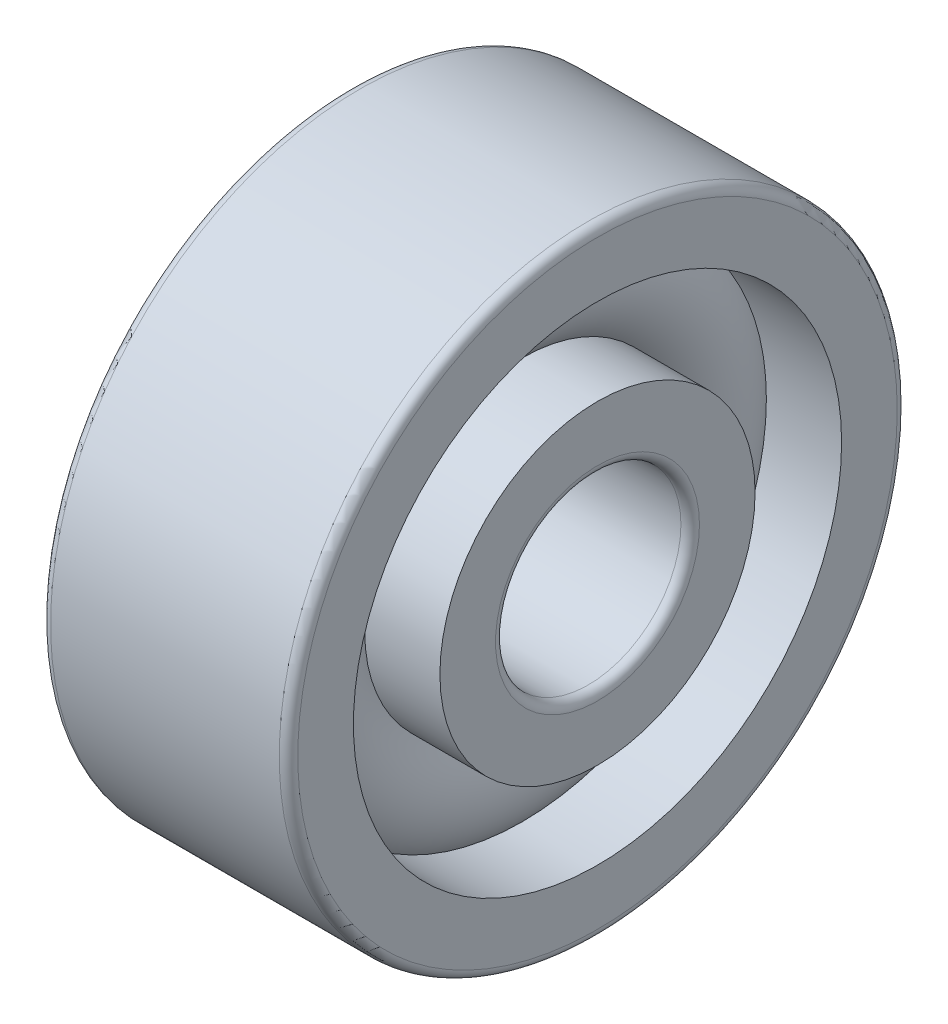
ISO-10303-21;
HEADER;
FILE_DESCRIPTION(('STEP AP214'),'2;1');
FILE_NAME('part.step','',(''),(''),'','','');
FILE_SCHEMA(('AUTOMOTIVE_DESIGN { 1 0 10303 214 1 1 1 1 }'));
ENDSEC;
DATA;
#1=APPLICATION_CONTEXT('core data for automotive mechanical design processes');
#2=APPLICATION_PROTOCOL_DEFINITION('international standard','automotive_design',2000,#1);
#3=PRODUCT_CONTEXT('',#1,'mechanical');
#4=PRODUCT('Part','Part','',(#3));
#5=PRODUCT_RELATED_PRODUCT_CATEGORY('part','',(#4));
#6=PRODUCT_DEFINITION_FORMATION('','',#4);
#7=PRODUCT_DEFINITION_CONTEXT('part definition',#1,'design');
#8=PRODUCT_DEFINITION('design','',#6,#7);
#9=PRODUCT_DEFINITION_SHAPE('','',#8);
#10=(LENGTH_UNIT() NAMED_UNIT(*) SI_UNIT(.MILLI.,.METRE.));
#11=(NAMED_UNIT(*) PLANE_ANGLE_UNIT() SI_UNIT($,.RADIAN.));
#12=(NAMED_UNIT(*) SI_UNIT($,.STERADIAN.) SOLID_ANGLE_UNIT());
#13=UNCERTAINTY_MEASURE_WITH_UNIT(LENGTH_MEASURE(1.E-05),#10,'distance_accuracy_value','');
#14=(GEOMETRIC_REPRESENTATION_CONTEXT(3) GLOBAL_UNCERTAINTY_ASSIGNED_CONTEXT((#13)) GLOBAL_UNIT_ASSIGNED_CONTEXT((#10,
#11,#12)) REPRESENTATION_CONTEXT('',''));
#15=CARTESIAN_POINT('',(0.,0.,0.));
#16=DIRECTION('',(0.,0.,1.));
#17=DIRECTION('',(1.,0.,0.));
#18=AXIS2_PLACEMENT_3D('',#15,#16,#17);
#19=CARTESIAN_POINT('',(0.,0.,0.));
#20=DIRECTION('',(-1.,0.,0.));
#21=DIRECTION('',(0.,0.,1.));
#22=AXIS2_PLACEMENT_3D('',#19,#20,#21);
#23=TOROIDAL_SURFACE('',#22,3.25,1.05);
#24=CARTESIAN_POINT('',(0.782623792124921,0.,0.));
#25=DIRECTION('',(-1.,0.,0.));
#26=DIRECTION('',(0.,0.,1.));
#27=AXIS2_PLACEMENT_3D('',#24,#25,#26);
#28=CIRCLE('',#27,3.95000000000001);
#29=CARTESIAN_POINT('',(0.782623792124921,0.,3.95000000000001));
#30=VERTEX_POINT('',#29);
#31=EDGE_CURVE('E47',#30,#30,#28,.F.);
#32=ORIENTED_EDGE('',*,*,#31,.T.);
#33=EDGE_LOOP('',(#32));
#34=FACE_BOUND('',#33,.T.);
#35=CARTESIAN_POINT('',(0.782623792124926,0.,0.));
#36=DIRECTION('',(-1.,0.,0.));
#37=DIRECTION('',(0.,0.,1.));
#38=AXIS2_PLACEMENT_3D('',#35,#36,#37);
#39=CIRCLE('',#38,2.55);
#40=CARTESIAN_POINT('',(0.782623792124926,0.,2.55));
#41=VERTEX_POINT('',#40);
#42=EDGE_CURVE('E10',#41,#41,#39,.T.);
#43=ORIENTED_EDGE('',*,*,#42,.T.);
#44=EDGE_LOOP('',(#43));
#45=FACE_BOUND('',#44,.T.);
#46=ADVANCED_FACE('F43',(#34,#45),#23,.T.);
#47=CARTESIAN_POINT('',(-20.6375,0.,0.));
#48=DIRECTION('',(1.,0.,0.));
#49=DIRECTION('',(0.,0.,-1.));
#50=AXIS2_PLACEMENT_3D('',#47,#48,#49);
#51=CYLINDRICAL_SURFACE('',#50,2.55);
#52=CARTESIAN_POINT('',(2.,0.,0.));
#53=DIRECTION('',(1.,0.,0.));
#54=DIRECTION('',(0.,0.,-1.));
#55=AXIS2_PLACEMENT_3D('',#52,#53,#54);
#56=CIRCLE('',#55,2.55);
#57=CARTESIAN_POINT('',(2.,0.,-2.55));
#58=VERTEX_POINT('',#57);
#59=EDGE_CURVE('E58',#58,#58,#56,.T.);
#60=ORIENTED_EDGE('',*,*,#59,.F.);
#61=EDGE_LOOP('',(#60));
#62=FACE_BOUND('',#61,.T.);
#63=ORIENTED_EDGE('',*,*,#42,.F.);
#64=EDGE_LOOP('',(#63));
#65=FACE_BOUND('',#64,.T.);
#66=ADVANCED_FACE('F107',(#62,#65),#51,.T.);
#67=CARTESIAN_POINT('',(-20.6375,0.,0.));
#68=DIRECTION('',(1.,0.,0.));
#69=DIRECTION('',(0.,0.,-1.));
#70=AXIS2_PLACEMENT_3D('',#67,#68,#69);
#71=CYLINDRICAL_SURFACE('',#70,2.55);
#72=CARTESIAN_POINT('',(-2.,0.,0.));
#73=DIRECTION('',(1.,0.,0.));
#74=DIRECTION('',(0.,0.,-1.));
#75=AXIS2_PLACEMENT_3D('',#72,#73,#74);
#76=CIRCLE('',#75,2.55);
#77=CARTESIAN_POINT('',(-2.,0.,-2.55));
#78=VERTEX_POINT('',#77);
#79=EDGE_CURVE('E70',#78,#78,#76,.T.);
#80=ORIENTED_EDGE('',*,*,#79,.T.);
#81=EDGE_LOOP('',(#80));
#82=FACE_BOUND('',#81,.T.);
#83=CARTESIAN_POINT('',(-0.782623792124926,0.,0.));
#84=DIRECTION('',(1.,0.,0.));
#85=DIRECTION('',(0.,0.,-1.));
#86=AXIS2_PLACEMENT_3D('',#83,#84,#85);
#87=CIRCLE('',#86,2.55);
#88=CARTESIAN_POINT('',(-0.782623792124926,0.,-2.55));
#89=VERTEX_POINT('',#88);
#90=EDGE_CURVE('E52',#89,#89,#87,.T.);
#91=ORIENTED_EDGE('',*,*,#90,.F.);
#92=EDGE_LOOP('',(#91));
#93=FACE_BOUND('',#92,.T.);
#94=ADVANCED_FACE('F110',(#82,#93),#71,.T.);
#95=CARTESIAN_POINT('',(2.,1.65,0.));
#96=DIRECTION('',(1.,0.,0.));
#97=DIRECTION('',(0.,0.,-1.));
#98=AXIS2_PLACEMENT_3D('',#95,#96,#97);
#99=PLANE('',#98);
#100=ORIENTED_EDGE('',*,*,#59,.T.);
#101=EDGE_LOOP('',(#100));
#102=FACE_BOUND('',#101,.T.);
#103=CARTESIAN_POINT('',(2.,0.,0.));
#104=DIRECTION('',(1.,0.,0.));
#105=DIRECTION('',(0.,0.,-1.));
#106=AXIS2_PLACEMENT_3D('',#103,#104,#105);
#107=CIRCLE('',#106,1.65);
#108=CARTESIAN_POINT('',(2.,0.,-1.65));
#109=VERTEX_POINT('',#108);
#110=EDGE_CURVE('E97',#109,#109,#107,.T.);
#111=ORIENTED_EDGE('',*,*,#110,.F.);
#112=EDGE_LOOP('',(#111));
#113=FACE_BOUND('',#112,.T.);
#114=ADVANCED_FACE('F104',(#102,#113),#99,.T.);
#115=CARTESIAN_POINT('',(1.85,0.,0.));
#116=DIRECTION('',(1.,0.,0.));
#117=DIRECTION('',(0.,0.,-1.));
#118=AXIS2_PLACEMENT_3D('',#115,#116,#117);
#119=TOROIDAL_SURFACE('',#118,1.65,0.15);
#120=ORIENTED_EDGE('',*,*,#110,.T.);
#121=EDGE_LOOP('',(#120));
#122=FACE_BOUND('',#121,.T.);
#123=CARTESIAN_POINT('',(1.85,0.,0.));
#124=DIRECTION('',(1.,0.,0.));
#125=DIRECTION('',(0.,0.,-1.));
#126=AXIS2_PLACEMENT_3D('',#123,#124,#125);
#127=CIRCLE('',#126,1.5);
#128=CARTESIAN_POINT('',(1.85,0.,-1.5));
#129=VERTEX_POINT('',#128);
#130=EDGE_CURVE('E93',#129,#129,#127,.T.);
#131=ORIENTED_EDGE('',*,*,#130,.F.);
#132=EDGE_LOOP('',(#131));
#133=FACE_BOUND('',#132,.T.);
#134=ADVANCED_FACE('F121',(#122,#133),#119,.T.);
#135=CARTESIAN_POINT('',(-20.6375,0.,0.));
#136=DIRECTION('',(1.,0.,0.));
#137=DIRECTION('',(0.,0.,-1.));
#138=AXIS2_PLACEMENT_3D('',#135,#136,#137);
#139=CYLINDRICAL_SURFACE('',#138,1.5);
#140=ORIENTED_EDGE('',*,*,#130,.T.);
#141=EDGE_LOOP('',(#140));
#142=FACE_BOUND('',#141,.T.);
#143=CARTESIAN_POINT('',(-1.85,0.,0.));
#144=DIRECTION('',(1.,0.,0.));
#145=DIRECTION('',(0.,0.,-1.));
#146=AXIS2_PLACEMENT_3D('',#143,#144,#145);
#147=CIRCLE('',#146,1.5);
#148=CARTESIAN_POINT('',(-1.85,0.,-1.5));
#149=VERTEX_POINT('',#148);
#150=EDGE_CURVE('E89',#149,#149,#147,.T.);
#151=ORIENTED_EDGE('',*,*,#150,.F.);
#152=EDGE_LOOP('',(#151));
#153=FACE_BOUND('',#152,.T.);
#154=ADVANCED_FACE('F124',(#142,#153),#139,.F.);
#155=CARTESIAN_POINT('',(-1.85,0.,0.));
#156=DIRECTION('',(1.,0.,0.));
#157=DIRECTION('',(0.,0.,-1.));
#158=AXIS2_PLACEMENT_3D('',#155,#156,#157);
#159=TOROIDAL_SURFACE('',#158,1.65,0.15);
#160=ORIENTED_EDGE('',*,*,#150,.T.);
#161=EDGE_LOOP('',(#160));
#162=FACE_BOUND('',#161,.T.);
#163=CARTESIAN_POINT('',(-2.,0.,0.));
#164=DIRECTION('',(1.,0.,0.));
#165=DIRECTION('',(0.,0.,-1.));
#166=AXIS2_PLACEMENT_3D('',#163,#164,#165);
#167=CIRCLE('',#166,1.65);
#168=CARTESIAN_POINT('',(-2.,0.,-1.65));
#169=VERTEX_POINT('',#168);
#170=EDGE_CURVE('E85',#169,#169,#167,.T.);
#171=ORIENTED_EDGE('',*,*,#170,.F.);
#172=EDGE_LOOP('',(#171));
#173=FACE_BOUND('',#172,.T.);
#174=ADVANCED_FACE('F128',(#162,#173),#159,.T.);
#175=CARTESIAN_POINT('',(-2.,2.55,0.));
#176=DIRECTION('',(-1.,0.,0.));
#177=DIRECTION('',(0.,0.,1.));
#178=AXIS2_PLACEMENT_3D('',#175,#176,#177);
#179=PLANE('',#178);
#180=ORIENTED_EDGE('',*,*,#170,.T.);
#181=EDGE_LOOP('',(#180));
#182=FACE_BOUND('',#181,.T.);
#183=ORIENTED_EDGE('',*,*,#79,.F.);
#184=EDGE_LOOP('',(#183));
#185=FACE_BOUND('',#184,.T.);
#186=ADVANCED_FACE('F132',(#182,#185),#179,.T.);
#187=CARTESIAN_POINT('',(-0.782623792124921,0.,0.));
#188=DIRECTION('',(1.,0.,0.));
#189=DIRECTION('',(0.,0.,-1.));
#190=AXIS2_PLACEMENT_3D('',#187,#188,#189);
#191=CIRCLE('',#190,3.95000000000001);
#192=CARTESIAN_POINT('',(-0.782623792124921,0.,-3.95000000000001));
#193=VERTEX_POINT('',#192);
#194=EDGE_CURVE('E61',#193,#193,#191,.F.);
#195=ORIENTED_EDGE('',*,*,#194,.T.);
#196=EDGE_LOOP('',(#195));
#197=FACE_BOUND('',#196,.T.);
#198=ORIENTED_EDGE('',*,*,#90,.T.);
#199=EDGE_LOOP('',(#198));
#200=FACE_BOUND('',#199,.T.);
#201=ADVANCED_FACE('F45',(#197,#200),#23,.T.);
#202=CARTESIAN_POINT('',(-20.6375,0.,0.));
#203=DIRECTION('',(1.,0.,0.));
#204=DIRECTION('',(0.,0.,-1.));
#205=AXIS2_PLACEMENT_3D('',#202,#203,#204);
#206=CYLINDRICAL_SURFACE('',#205,3.95000000000001);
#207=CARTESIAN_POINT('',(2.,0.,0.));
#208=DIRECTION('',(1.,0.,0.));
#209=DIRECTION('',(0.,0.,-1.));
#210=AXIS2_PLACEMENT_3D('',#207,#208,#209);
#211=CIRCLE('',#210,3.95000000000001);
#212=CARTESIAN_POINT('',(2.,0.,-3.95000000000001));
#213=VERTEX_POINT('',#212);
#214=EDGE_CURVE('E64',#213,#213,#211,.T.);
#215=ORIENTED_EDGE('',*,*,#214,.T.);
#216=EDGE_LOOP('',(#215));
#217=FACE_BOUND('',#216,.T.);
#218=ORIENTED_EDGE('',*,*,#31,.F.);
#219=EDGE_LOOP('',(#218));
#220=FACE_BOUND('',#219,.T.);
#221=ADVANCED_FACE('F137',(#217,#220),#206,.F.);
#222=CARTESIAN_POINT('',(-20.6375,0.,0.));
#223=DIRECTION('',(1.,0.,0.));
#224=DIRECTION('',(0.,0.,-1.));
#225=AXIS2_PLACEMENT_3D('',#222,#223,#224);
#226=CYLINDRICAL_SURFACE('',#225,3.95000000000001);
#227=CARTESIAN_POINT('',(-2.,0.,0.));
#228=DIRECTION('',(1.,0.,0.));
#229=DIRECTION('',(0.,0.,-1.));
#230=AXIS2_PLACEMENT_3D('',#227,#228,#229);
#231=CIRCLE('',#230,3.95000000000001);
#232=CARTESIAN_POINT('',(-2.,0.,-3.95000000000001));
#233=VERTEX_POINT('',#232);
#234=EDGE_CURVE('E168',#233,#233,#231,.T.);
#235=ORIENTED_EDGE('',*,*,#234,.F.);
#236=EDGE_LOOP('',(#235));
#237=FACE_BOUND('',#236,.T.);
#238=ORIENTED_EDGE('',*,*,#194,.F.);
#239=EDGE_LOOP('',(#238));
#240=FACE_BOUND('',#239,.T.);
#241=ADVANCED_FACE('F140',(#237,#240),#226,.F.);
#242=CARTESIAN_POINT('',(2.,4.85,0.));
#243=DIRECTION('',(1.,0.,0.));
#244=DIRECTION('',(0.,0.,-1.));
#245=AXIS2_PLACEMENT_3D('',#242,#243,#244);
#246=PLANE('',#245);
#247=CARTESIAN_POINT('',(2.,0.,0.));
#248=DIRECTION('',(1.,0.,0.));
#249=DIRECTION('',(0.,0.,-1.));
#250=AXIS2_PLACEMENT_3D('',#247,#248,#249);
#251=CIRCLE('',#250,4.85);
#252=CARTESIAN_POINT('',(2.,0.,-4.85));
#253=VERTEX_POINT('',#252);
#254=EDGE_CURVE('E72',#253,#253,#251,.T.);
#255=ORIENTED_EDGE('',*,*,#254,.T.);
#256=EDGE_LOOP('',(#255));
#257=FACE_BOUND('',#256,.T.);
#258=ORIENTED_EDGE('',*,*,#214,.F.);
#259=EDGE_LOOP('',(#258));
#260=FACE_BOUND('',#259,.T.);
#261=ADVANCED_FACE('F141',(#257,#260),#246,.T.);
#262=CARTESIAN_POINT('',(1.85,0.,0.));
#263=DIRECTION('',(1.,0.,0.));
#264=DIRECTION('',(0.,0.,-1.));
#265=AXIS2_PLACEMENT_3D('',#262,#263,#264);
#266=TOROIDAL_SURFACE('',#265,4.85,0.15);
#267=CARTESIAN_POINT('',(1.85,0.,0.));
#268=DIRECTION('',(1.,0.,0.));
#269=DIRECTION('',(0.,0.,-1.));
#270=AXIS2_PLACEMENT_3D('',#267,#268,#269);
#271=CIRCLE('',#270,5.);
#272=CARTESIAN_POINT('',(1.85,0.,-5.));
#273=VERTEX_POINT('',#272);
#274=EDGE_CURVE('E78',#273,#273,#271,.T.);
#275=ORIENTED_EDGE('',*,*,#274,.T.);
#276=EDGE_LOOP('',(#275));
#277=FACE_BOUND('',#276,.T.);
#278=ORIENTED_EDGE('',*,*,#254,.F.);
#279=EDGE_LOOP('',(#278));
#280=FACE_BOUND('',#279,.T.);
#281=ADVANCED_FACE('F144',(#277,#280),#266,.T.);
#282=CARTESIAN_POINT('',(-20.6375,0.,0.));
#283=DIRECTION('',(1.,0.,0.));
#284=DIRECTION('',(0.,0.,-1.));
#285=AXIS2_PLACEMENT_3D('',#282,#283,#284);
#286=CYLINDRICAL_SURFACE('',#285,5.);
#287=CARTESIAN_POINT('',(-1.85,0.,0.));
#288=DIRECTION('',(1.,0.,0.));
#289=DIRECTION('',(0.,0.,-1.));
#290=AXIS2_PLACEMENT_3D('',#287,#288,#289);
#291=CIRCLE('',#290,5.);
#292=CARTESIAN_POINT('',(-1.85,0.,-5.));
#293=VERTEX_POINT('',#292);
#294=EDGE_CURVE('E174',#293,#293,#291,.T.);
#295=ORIENTED_EDGE('',*,*,#294,.T.);
#296=EDGE_LOOP('',(#295));
#297=FACE_BOUND('',#296,.T.);
#298=ORIENTED_EDGE('',*,*,#274,.F.);
#299=EDGE_LOOP('',(#298));
#300=FACE_BOUND('',#299,.T.);
#301=ADVANCED_FACE('F148',(#297,#300),#286,.T.);
#302=CARTESIAN_POINT('',(-1.85,0.,0.));
#303=DIRECTION('',(1.,0.,0.));
#304=DIRECTION('',(0.,0.,-1.));
#305=AXIS2_PLACEMENT_3D('',#302,#303,#304);
#306=TOROIDAL_SURFACE('',#305,4.85,0.15);
#307=CARTESIAN_POINT('',(-2.,0.,0.));
#308=DIRECTION('',(1.,0.,0.));
#309=DIRECTION('',(0.,0.,-1.));
#310=AXIS2_PLACEMENT_3D('',#307,#308,#309);
#311=CIRCLE('',#310,4.85);
#312=CARTESIAN_POINT('',(-2.,0.,-4.85));
#313=VERTEX_POINT('',#312);
#314=EDGE_CURVE('E170',#313,#313,#311,.T.);
#315=ORIENTED_EDGE('',*,*,#314,.T.);
#316=EDGE_LOOP('',(#315));
#317=FACE_BOUND('',#316,.T.);
#318=ORIENTED_EDGE('',*,*,#294,.F.);
#319=EDGE_LOOP('',(#318));
#320=FACE_BOUND('',#319,.T.);
#321=ADVANCED_FACE('F152',(#317,#320),#306,.T.);
#322=CARTESIAN_POINT('',(-2.,3.95000000000001,0.));
#323=DIRECTION('',(-1.,0.,0.));
#324=DIRECTION('',(0.,0.,1.));
#325=AXIS2_PLACEMENT_3D('',#322,#323,#324);
#326=PLANE('',#325);
#327=ORIENTED_EDGE('',*,*,#234,.T.);
#328=EDGE_LOOP('',(#327));
#329=FACE_BOUND('',#328,.T.);
#330=ORIENTED_EDGE('',*,*,#314,.F.);
#331=EDGE_LOOP('',(#330));
#332=FACE_BOUND('',#331,.T.);
#333=ADVANCED_FACE('F156',(#329,#332),#326,.T.);
#334=CLOSED_SHELL('',(#46,#66,#94,#114,#134,#154,#174,#186,#201,#221,#241,#261,#281,#301,#321,#333));
#335=MANIFOLD_SOLID_BREP('B2',#334);
#336=ADVANCED_BREP_SHAPE_REPRESENTATION('',(#18,#335),#14);
#337=SHAPE_DEFINITION_REPRESENTATION(#9,#336);
ENDSEC;
END-ISO-10303-21;
